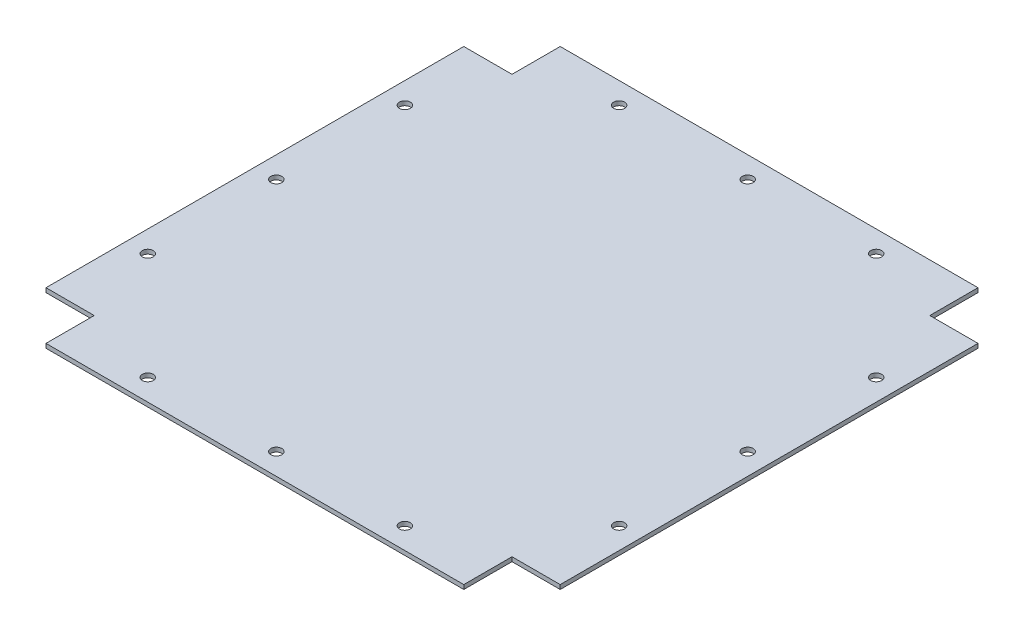
ISO-10303-21;
HEADER;
FILE_DESCRIPTION(('STEP AP214'),'2;1');
FILE_NAME('part.step','',(''),(''),'','','');
FILE_SCHEMA(('AUTOMOTIVE_DESIGN { 1 0 10303 214 1 1 1 1 }'));
ENDSEC;
DATA;
#1=APPLICATION_CONTEXT('core data for automotive mechanical design processes');
#2=APPLICATION_PROTOCOL_DEFINITION('international standard','automotive_design',2000,#1);
#3=PRODUCT_CONTEXT('',#1,'mechanical');
#4=PRODUCT('Part','Part','',(#3));
#5=PRODUCT_RELATED_PRODUCT_CATEGORY('part','',(#4));
#6=PRODUCT_DEFINITION_FORMATION('','',#4);
#7=PRODUCT_DEFINITION_CONTEXT('part definition',#1,'design');
#8=PRODUCT_DEFINITION('design','',#6,#7);
#9=PRODUCT_DEFINITION_SHAPE('','',#8);
#10=(LENGTH_UNIT() NAMED_UNIT(*) SI_UNIT(.MILLI.,.METRE.));
#11=(NAMED_UNIT(*) PLANE_ANGLE_UNIT() SI_UNIT($,.RADIAN.));
#12=(NAMED_UNIT(*) SI_UNIT($,.STERADIAN.) SOLID_ANGLE_UNIT());
#13=UNCERTAINTY_MEASURE_WITH_UNIT(LENGTH_MEASURE(1.E-05),#10,'distance_accuracy_value','');
#14=(GEOMETRIC_REPRESENTATION_CONTEXT(3) GLOBAL_UNCERTAINTY_ASSIGNED_CONTEXT((#13)) GLOBAL_UNIT_ASSIGNED_CONTEXT((#10,
#11,#12)) REPRESENTATION_CONTEXT('',''));
#15=CARTESIAN_POINT('',(0.,0.,0.));
#16=DIRECTION('',(0.,0.,1.));
#17=DIRECTION('',(1.,0.,0.));
#18=AXIS2_PLACEMENT_3D('',#15,#16,#17);
#19=CARTESIAN_POINT('',(0.,2.54,0.));
#20=DIRECTION('',(0.,-1.,0.));
#21=DIRECTION('',(0.,0.,-1.));
#22=AXIS2_PLACEMENT_3D('',#19,#20,#21);
#23=PLANE('',#22);
#24=CARTESIAN_POINT('',(-139.7,2.54,0.));
#25=DIRECTION('',(0.,1.,0.));
#26=DIRECTION('',(0.,0.,-1.));
#27=AXIS2_PLACEMENT_3D('',#24,#25,#26);
#28=CIRCLE('',#27,3.2385);
#29=CARTESIAN_POINT('',(-139.7,2.54,-3.23850000000006));
#30=VERTEX_POINT('',#29);
#31=EDGE_CURVE('E324',#30,#30,#28,.T.);
#32=ORIENTED_EDGE('',*,*,#31,.F.);
#33=EDGE_LOOP('',(#32));
#34=FACE_BOUND('',#33,.T.);
#35=CARTESIAN_POINT('',(139.7,2.54,-76.2000000000001));
#36=DIRECTION('',(0.,1.,0.));
#37=DIRECTION('',(0.,0.,1.));
#38=AXIS2_PLACEMENT_3D('',#35,#36,#37);
#39=CIRCLE('',#38,3.23850000000008);
#40=CARTESIAN_POINT('',(139.7,2.54,-72.9615000000001));
#41=VERTEX_POINT('',#40);
#42=EDGE_CURVE('E336',#41,#41,#39,.T.);
#43=ORIENTED_EDGE('',*,*,#42,.F.);
#44=EDGE_LOOP('',(#43));
#45=FACE_BOUND('',#44,.T.);
#46=CARTESIAN_POINT('',(139.7,2.54,76.1999999999999));
#47=DIRECTION('',(0.,1.,0.));
#48=DIRECTION('',(0.,0.,1.));
#49=AXIS2_PLACEMENT_3D('',#46,#47,#48);
#50=CIRCLE('',#49,3.23850000000004);
#51=CARTESIAN_POINT('',(139.7,2.54,79.4384999999999));
#52=VERTEX_POINT('',#51);
#53=EDGE_CURVE('E348',#52,#52,#50,.T.);
#54=ORIENTED_EDGE('',*,*,#53,.F.);
#55=EDGE_LOOP('',(#54));
#56=FACE_BOUND('',#55,.T.);
#57=CARTESIAN_POINT('',(0.,2.54,139.7));
#58=DIRECTION('',(0.,1.,0.));
#59=DIRECTION('',(0.,0.,-1.));
#60=AXIS2_PLACEMENT_3D('',#57,#58,#59);
#61=CIRCLE('',#60,3.23850000000002);
#62=CARTESIAN_POINT('',(0.,2.54,136.4615));
#63=VERTEX_POINT('',#62);
#64=EDGE_CURVE('E360',#63,#63,#61,.T.);
#65=ORIENTED_EDGE('',*,*,#64,.F.);
#66=EDGE_LOOP('',(#65));
#67=FACE_BOUND('',#66,.T.);
#68=CARTESIAN_POINT('',(-76.2,2.54,-139.7));
#69=DIRECTION('',(0.,1.,0.));
#70=DIRECTION('',(0.,0.,1.));
#71=AXIS2_PLACEMENT_3D('',#68,#69,#70);
#72=CIRCLE('',#71,3.2385);
#73=CARTESIAN_POINT('',(-76.2,2.54,-136.4615));
#74=VERTEX_POINT('',#73);
#75=EDGE_CURVE('E372',#74,#74,#72,.T.);
#76=ORIENTED_EDGE('',*,*,#75,.F.);
#77=EDGE_LOOP('',(#76));
#78=FACE_BOUND('',#77,.T.);
#79=CARTESIAN_POINT('',(76.2,2.54,-139.7));
#80=DIRECTION('',(0.,1.,0.));
#81=DIRECTION('',(0.,0.,1.));
#82=AXIS2_PLACEMENT_3D('',#79,#80,#81);
#83=CIRCLE('',#82,3.2385);
#84=CARTESIAN_POINT('',(76.2,2.54,-136.4615));
#85=VERTEX_POINT('',#84);
#86=EDGE_CURVE('E158',#85,#85,#83,.T.);
#87=ORIENTED_EDGE('',*,*,#86,.F.);
#88=EDGE_LOOP('',(#87));
#89=FACE_BOUND('',#88,.T.);
#90=DIRECTION('',(-1.,0.,0.));
#91=VECTOR('',#90,1.);
#92=CARTESIAN_POINT('',(-123.825,2.54,-152.4));
#93=LINE('',#92,#91);
#94=CARTESIAN_POINT('',(123.825,2.54,-152.4));
#95=VERTEX_POINT('',#94);
#96=CARTESIAN_POINT('',(-123.825,2.54,-152.4));
#97=VERTEX_POINT('',#96);
#98=EDGE_CURVE('E177',#95,#97,#93,.T.);
#99=ORIENTED_EDGE('',*,*,#98,.T.);
#100=DIRECTION('',(0.,0.,1.));
#101=VECTOR('',#100,1.);
#102=CARTESIAN_POINT('',(-123.825,2.54,-123.825));
#103=LINE('',#102,#101);
#104=CARTESIAN_POINT('',(-123.825,2.54,-123.825));
#105=VERTEX_POINT('',#104);
#106=EDGE_CURVE('E105',#97,#105,#103,.T.);
#107=ORIENTED_EDGE('',*,*,#106,.T.);
#108=DIRECTION('',(-1.,0.,0.));
#109=VECTOR('',#108,1.);
#110=CARTESIAN_POINT('',(-152.4,2.54,-123.825));
#111=LINE('',#110,#109);
#112=CARTESIAN_POINT('',(-152.4,2.54,-123.825));
#113=VERTEX_POINT('',#112);
#114=EDGE_CURVE('E204',#105,#113,#111,.T.);
#115=ORIENTED_EDGE('',*,*,#114,.T.);
#116=DIRECTION('',(0.,0.,1.));
#117=VECTOR('',#116,1.);
#118=CARTESIAN_POINT('',(-152.4,2.54,123.825));
#119=LINE('',#118,#117);
#120=CARTESIAN_POINT('',(-152.4,2.54,123.825));
#121=VERTEX_POINT('',#120);
#122=EDGE_CURVE('E223',#113,#121,#119,.T.);
#123=ORIENTED_EDGE('',*,*,#122,.T.);
#124=DIRECTION('',(1.,0.,0.));
#125=VECTOR('',#124,1.);
#126=CARTESIAN_POINT('',(-152.4,2.54,123.825));
#127=LINE('',#126,#125);
#128=CARTESIAN_POINT('',(-123.825,2.54,123.825));
#129=VERTEX_POINT('',#128);
#130=EDGE_CURVE('E220',#121,#129,#127,.T.);
#131=ORIENTED_EDGE('',*,*,#130,.T.);
#132=DIRECTION('',(0.,0.,1.));
#133=VECTOR('',#132,1.);
#134=CARTESIAN_POINT('',(-123.825,2.54,123.825));
#135=LINE('',#134,#133);
#136=CARTESIAN_POINT('',(-123.825,2.54,152.4));
#137=VERTEX_POINT('',#136);
#138=EDGE_CURVE('E222',#129,#137,#135,.T.);
#139=ORIENTED_EDGE('',*,*,#138,.T.);
#140=DIRECTION('',(1.,0.,0.));
#141=VECTOR('',#140,1.);
#142=CARTESIAN_POINT('',(-123.825,2.54,152.4));
#143=LINE('',#142,#141);
#144=CARTESIAN_POINT('',(123.825,2.54,152.4));
#145=VERTEX_POINT('',#144);
#146=EDGE_CURVE('E225',#137,#145,#143,.T.);
#147=ORIENTED_EDGE('',*,*,#146,.T.);
#148=DIRECTION('',(0.,0.,-1.));
#149=VECTOR('',#148,1.);
#150=CARTESIAN_POINT('',(123.825,2.54,152.4));
#151=LINE('',#150,#149);
#152=CARTESIAN_POINT('',(123.825,2.54,123.825));
#153=VERTEX_POINT('',#152);
#154=EDGE_CURVE('E231',#145,#153,#151,.T.);
#155=ORIENTED_EDGE('',*,*,#154,.T.);
#156=DIRECTION('',(1.,0.,0.));
#157=VECTOR('',#156,1.);
#158=CARTESIAN_POINT('',(123.825,2.54,123.825));
#159=LINE('',#158,#157);
#160=CARTESIAN_POINT('',(152.4,2.54,123.825));
#161=VERTEX_POINT('',#160);
#162=EDGE_CURVE('E136',#153,#161,#159,.T.);
#163=ORIENTED_EDGE('',*,*,#162,.T.);
#164=DIRECTION('',(0.,0.,-1.));
#165=VECTOR('',#164,1.);
#166=CARTESIAN_POINT('',(152.4,2.54,123.825));
#167=LINE('',#166,#165);
#168=CARTESIAN_POINT('',(152.4,2.54,-123.825));
#169=VERTEX_POINT('',#168);
#170=EDGE_CURVE('E130',#161,#169,#167,.T.);
#171=ORIENTED_EDGE('',*,*,#170,.T.);
#172=DIRECTION('',(-1.,0.,0.));
#173=VECTOR('',#172,1.);
#174=CARTESIAN_POINT('',(123.825,2.54,-123.825));
#175=LINE('',#174,#173);
#176=CARTESIAN_POINT('',(123.825,2.54,-123.825));
#177=VERTEX_POINT('',#176);
#178=EDGE_CURVE('E134',#169,#177,#175,.T.);
#179=ORIENTED_EDGE('',*,*,#178,.T.);
#180=DIRECTION('',(0.,0.,-1.));
#181=VECTOR('',#180,1.);
#182=CARTESIAN_POINT('',(123.825,2.54,-152.4));
#183=LINE('',#182,#181);
#184=EDGE_CURVE('E50',#177,#95,#183,.T.);
#185=ORIENTED_EDGE('',*,*,#184,.T.);
#186=EDGE_LOOP('',(#99,#107,#115,#123,#131,#139,#147,#155,#163,#171,#179,#185));
#187=FACE_BOUND('',#186,.T.);
#188=CARTESIAN_POINT('',(0.,2.54,-139.7));
#189=DIRECTION('',(0.,1.,0.));
#190=DIRECTION('',(0.,0.,1.));
#191=AXIS2_PLACEMENT_3D('',#188,#189,#190);
#192=CIRCLE('',#191,3.2385);
#193=CARTESIAN_POINT('',(0.,2.54,-136.4615));
#194=VERTEX_POINT('',#193);
#195=EDGE_CURVE('E378',#194,#194,#192,.T.);
#196=ORIENTED_EDGE('',*,*,#195,.F.);
#197=EDGE_LOOP('',(#196));
#198=FACE_BOUND('',#197,.T.);
#199=CARTESIAN_POINT('',(-76.2,2.54,139.7));
#200=DIRECTION('',(0.,1.,0.));
#201=DIRECTION('',(0.,0.,-1.));
#202=AXIS2_PLACEMENT_3D('',#199,#200,#201);
#203=CIRCLE('',#202,3.23849999999999);
#204=CARTESIAN_POINT('',(-76.2,2.54,136.4615));
#205=VERTEX_POINT('',#204);
#206=EDGE_CURVE('E366',#205,#205,#203,.T.);
#207=ORIENTED_EDGE('',*,*,#206,.F.);
#208=EDGE_LOOP('',(#207));
#209=FACE_BOUND('',#208,.T.);
#210=CARTESIAN_POINT('',(76.2,2.54,139.7));
#211=DIRECTION('',(0.,1.,0.));
#212=DIRECTION('',(0.,0.,-1.));
#213=AXIS2_PLACEMENT_3D('',#210,#211,#212);
#214=CIRCLE('',#213,3.23850000000002);
#215=CARTESIAN_POINT('',(76.2,2.54,136.4615));
#216=VERTEX_POINT('',#215);
#217=EDGE_CURVE('E354',#216,#216,#214,.T.);
#218=ORIENTED_EDGE('',*,*,#217,.F.);
#219=EDGE_LOOP('',(#218));
#220=FACE_BOUND('',#219,.T.);
#221=CARTESIAN_POINT('',(139.7,2.54,-1.11022302462516E-13));
#222=DIRECTION('',(0.,1.,0.));
#223=DIRECTION('',(0.,0.,1.));
#224=AXIS2_PLACEMENT_3D('',#221,#222,#223);
#225=CIRCLE('',#224,3.23850000000011);
#226=CARTESIAN_POINT('',(139.7,2.54,3.2385));
#227=VERTEX_POINT('',#226);
#228=EDGE_CURVE('E342',#227,#227,#225,.T.);
#229=ORIENTED_EDGE('',*,*,#228,.F.);
#230=EDGE_LOOP('',(#229));
#231=FACE_BOUND('',#230,.T.);
#232=CARTESIAN_POINT('',(-139.7,2.54,-76.2));
#233=DIRECTION('',(0.,1.,0.));
#234=DIRECTION('',(0.,0.,-1.));
#235=AXIS2_PLACEMENT_3D('',#232,#233,#234);
#236=CIRCLE('',#235,3.23850000000001);
#237=CARTESIAN_POINT('',(-139.7,2.54,-79.4385));
#238=VERTEX_POINT('',#237);
#239=EDGE_CURVE('E330',#238,#238,#236,.T.);
#240=ORIENTED_EDGE('',*,*,#239,.F.);
#241=EDGE_LOOP('',(#240));
#242=FACE_BOUND('',#241,.T.);
#243=CARTESIAN_POINT('',(-139.7,2.54,76.1999999999999));
#244=DIRECTION('',(0.,1.,0.));
#245=DIRECTION('',(0.,0.,-1.));
#246=AXIS2_PLACEMENT_3D('',#243,#244,#245);
#247=CIRCLE('',#246,3.23850000000002);
#248=CARTESIAN_POINT('',(-139.7,2.54,72.9614999999999));
#249=VERTEX_POINT('',#248);
#250=EDGE_CURVE('E315',#249,#249,#247,.T.);
#251=ORIENTED_EDGE('',*,*,#250,.F.);
#252=EDGE_LOOP('',(#251));
#253=FACE_BOUND('',#252,.T.);
#254=ADVANCED_FACE('F33',(#34,#45,#56,#67,#78,#89,#187,#198,#209,#220,#231,#242,#253),#23,.F.);
#255=CARTESIAN_POINT('',(0.,0.,0.));
#256=DIRECTION('',(0.,-1.,0.));
#257=DIRECTION('',(0.,0.,-1.));
#258=AXIS2_PLACEMENT_3D('',#255,#256,#257);
#259=PLANE('',#258);
#260=CARTESIAN_POINT('',(-139.7,0.,0.));
#261=DIRECTION('',(0.,1.,0.));
#262=DIRECTION('',(0.,0.,-1.));
#263=AXIS2_PLACEMENT_3D('',#260,#261,#262);
#264=CIRCLE('',#263,3.2385);
#265=CARTESIAN_POINT('',(-139.7,0.,-3.23850000000006));
#266=VERTEX_POINT('',#265);
#267=EDGE_CURVE('E321',#266,#266,#264,.T.);
#268=ORIENTED_EDGE('',*,*,#267,.T.);
#269=EDGE_LOOP('',(#268));
#270=FACE_BOUND('',#269,.T.);
#271=CARTESIAN_POINT('',(139.7,0.,-76.2000000000001));
#272=DIRECTION('',(0.,1.,0.));
#273=DIRECTION('',(0.,0.,1.));
#274=AXIS2_PLACEMENT_3D('',#271,#272,#273);
#275=CIRCLE('',#274,3.23850000000008);
#276=CARTESIAN_POINT('',(139.7,0.,-72.9615000000001));
#277=VERTEX_POINT('',#276);
#278=EDGE_CURVE('E333',#277,#277,#275,.T.);
#279=ORIENTED_EDGE('',*,*,#278,.T.);
#280=EDGE_LOOP('',(#279));
#281=FACE_BOUND('',#280,.T.);
#282=CARTESIAN_POINT('',(139.7,0.,76.1999999999999));
#283=DIRECTION('',(0.,1.,0.));
#284=DIRECTION('',(0.,0.,1.));
#285=AXIS2_PLACEMENT_3D('',#282,#283,#284);
#286=CIRCLE('',#285,3.23850000000004);
#287=CARTESIAN_POINT('',(139.7,0.,79.4384999999999));
#288=VERTEX_POINT('',#287);
#289=EDGE_CURVE('E345',#288,#288,#286,.T.);
#290=ORIENTED_EDGE('',*,*,#289,.T.);
#291=EDGE_LOOP('',(#290));
#292=FACE_BOUND('',#291,.T.);
#293=CARTESIAN_POINT('',(0.,0.,139.7));
#294=DIRECTION('',(0.,1.,0.));
#295=DIRECTION('',(0.,0.,-1.));
#296=AXIS2_PLACEMENT_3D('',#293,#294,#295);
#297=CIRCLE('',#296,3.23850000000002);
#298=CARTESIAN_POINT('',(0.,0.,136.4615));
#299=VERTEX_POINT('',#298);
#300=EDGE_CURVE('E357',#299,#299,#297,.T.);
#301=ORIENTED_EDGE('',*,*,#300,.T.);
#302=EDGE_LOOP('',(#301));
#303=FACE_BOUND('',#302,.T.);
#304=CARTESIAN_POINT('',(-76.2,0.,-139.7));
#305=DIRECTION('',(0.,1.,0.));
#306=DIRECTION('',(0.,0.,1.));
#307=AXIS2_PLACEMENT_3D('',#304,#305,#306);
#308=CIRCLE('',#307,3.2385);
#309=CARTESIAN_POINT('',(-76.2,0.,-136.4615));
#310=VERTEX_POINT('',#309);
#311=EDGE_CURVE('E369',#310,#310,#308,.T.);
#312=ORIENTED_EDGE('',*,*,#311,.T.);
#313=EDGE_LOOP('',(#312));
#314=FACE_BOUND('',#313,.T.);
#315=CARTESIAN_POINT('',(76.2,0.,-139.7));
#316=DIRECTION('',(0.,1.,0.));
#317=DIRECTION('',(0.,0.,1.));
#318=AXIS2_PLACEMENT_3D('',#315,#316,#317);
#319=CIRCLE('',#318,3.2385);
#320=CARTESIAN_POINT('',(76.2,0.,-136.4615));
#321=VERTEX_POINT('',#320);
#322=EDGE_CURVE('E381',#321,#321,#319,.T.);
#323=ORIENTED_EDGE('',*,*,#322,.T.);
#324=EDGE_LOOP('',(#323));
#325=FACE_BOUND('',#324,.T.);
#326=DIRECTION('',(-1.,0.,0.));
#327=VECTOR('',#326,1.);
#328=CARTESIAN_POINT('',(-123.825,0.,-152.4));
#329=LINE('',#328,#327);
#330=CARTESIAN_POINT('',(123.825,0.,-152.4));
#331=VERTEX_POINT('',#330);
#332=CARTESIAN_POINT('',(-123.825,0.,-152.4));
#333=VERTEX_POINT('',#332);
#334=EDGE_CURVE('E154',#331,#333,#329,.T.);
#335=ORIENTED_EDGE('',*,*,#334,.F.);
#336=DIRECTION('',(0.,0.,-1.));
#337=VECTOR('',#336,1.);
#338=CARTESIAN_POINT('',(123.825,0.,-152.4));
#339=LINE('',#338,#337);
#340=CARTESIAN_POINT('',(123.825,0.,-123.825));
#341=VERTEX_POINT('',#340);
#342=EDGE_CURVE('E97',#341,#331,#339,.T.);
#343=ORIENTED_EDGE('',*,*,#342,.F.);
#344=DIRECTION('',(-1.,0.,0.));
#345=VECTOR('',#344,1.);
#346=CARTESIAN_POINT('',(123.825,0.,-123.825));
#347=LINE('',#346,#345);
#348=CARTESIAN_POINT('',(152.4,0.,-123.825));
#349=VERTEX_POINT('',#348);
#350=EDGE_CURVE('E91',#349,#341,#347,.T.);
#351=ORIENTED_EDGE('',*,*,#350,.F.);
#352=DIRECTION('',(0.,0.,-1.));
#353=VECTOR('',#352,1.);
#354=CARTESIAN_POINT('',(152.4,0.,123.825));
#355=LINE('',#354,#353);
#356=CARTESIAN_POINT('',(152.4,0.,123.825));
#357=VERTEX_POINT('',#356);
#358=EDGE_CURVE('E144',#357,#349,#355,.T.);
#359=ORIENTED_EDGE('',*,*,#358,.F.);
#360=DIRECTION('',(1.,0.,0.));
#361=VECTOR('',#360,1.);
#362=CARTESIAN_POINT('',(123.825,0.,123.825));
#363=LINE('',#362,#361);
#364=CARTESIAN_POINT('',(123.825,0.,123.825));
#365=VERTEX_POINT('',#364);
#366=EDGE_CURVE('E172',#365,#357,#363,.T.);
#367=ORIENTED_EDGE('',*,*,#366,.F.);
#368=DIRECTION('',(0.,0.,-1.));
#369=VECTOR('',#368,1.);
#370=CARTESIAN_POINT('',(123.825,0.,152.4));
#371=LINE('',#370,#369);
#372=CARTESIAN_POINT('',(123.825,0.,152.4));
#373=VERTEX_POINT('',#372);
#374=EDGE_CURVE('E170',#373,#365,#371,.T.);
#375=ORIENTED_EDGE('',*,*,#374,.F.);
#376=DIRECTION('',(1.,0.,0.));
#377=VECTOR('',#376,1.);
#378=CARTESIAN_POINT('',(-123.825,0.,152.4));
#379=LINE('',#378,#377);
#380=CARTESIAN_POINT('',(-123.825,0.,152.4));
#381=VERTEX_POINT('',#380);
#382=EDGE_CURVE('E168',#381,#373,#379,.T.);
#383=ORIENTED_EDGE('',*,*,#382,.F.);
#384=DIRECTION('',(0.,0.,1.));
#385=VECTOR('',#384,1.);
#386=CARTESIAN_POINT('',(-123.825,0.,123.825));
#387=LINE('',#386,#385);
#388=CARTESIAN_POINT('',(-123.825,0.,123.825));
#389=VERTEX_POINT('',#388);
#390=EDGE_CURVE('E166',#389,#381,#387,.T.);
#391=ORIENTED_EDGE('',*,*,#390,.F.);
#392=DIRECTION('',(1.,0.,0.));
#393=VECTOR('',#392,1.);
#394=CARTESIAN_POINT('',(-152.4,0.,123.825));
#395=LINE('',#394,#393);
#396=CARTESIAN_POINT('',(-152.4,0.,123.825));
#397=VERTEX_POINT('',#396);
#398=EDGE_CURVE('E164',#397,#389,#395,.T.);
#399=ORIENTED_EDGE('',*,*,#398,.F.);
#400=DIRECTION('',(0.,0.,1.));
#401=VECTOR('',#400,1.);
#402=CARTESIAN_POINT('',(-152.4,0.,123.825));
#403=LINE('',#402,#401);
#404=CARTESIAN_POINT('',(-152.4,0.,-123.825));
#405=VERTEX_POINT('',#404);
#406=EDGE_CURVE('E162',#405,#397,#403,.T.);
#407=ORIENTED_EDGE('',*,*,#406,.F.);
#408=DIRECTION('',(-1.,0.,0.));
#409=VECTOR('',#408,1.);
#410=CARTESIAN_POINT('',(-152.4,0.,-123.825));
#411=LINE('',#410,#409);
#412=CARTESIAN_POINT('',(-123.825,0.,-123.825));
#413=VERTEX_POINT('',#412);
#414=EDGE_CURVE('E160',#413,#405,#411,.T.);
#415=ORIENTED_EDGE('',*,*,#414,.F.);
#416=DIRECTION('',(0.,0.,1.));
#417=VECTOR('',#416,1.);
#418=CARTESIAN_POINT('',(-123.825,0.,-123.825));
#419=LINE('',#418,#417);
#420=EDGE_CURVE('E157',#333,#413,#419,.T.);
#421=ORIENTED_EDGE('',*,*,#420,.F.);
#422=EDGE_LOOP('',(#335,#343,#351,#359,#367,#375,#383,#391,#399,#407,#415,#421));
#423=FACE_BOUND('',#422,.T.);
#424=CARTESIAN_POINT('',(0.,0.,-139.7));
#425=DIRECTION('',(0.,1.,0.));
#426=DIRECTION('',(0.,0.,1.));
#427=AXIS2_PLACEMENT_3D('',#424,#425,#426);
#428=CIRCLE('',#427,3.2385);
#429=CARTESIAN_POINT('',(0.,0.,-136.4615));
#430=VERTEX_POINT('',#429);
#431=EDGE_CURVE('E375',#430,#430,#428,.T.);
#432=ORIENTED_EDGE('',*,*,#431,.T.);
#433=EDGE_LOOP('',(#432));
#434=FACE_BOUND('',#433,.T.);
#435=CARTESIAN_POINT('',(-76.2,0.,139.7));
#436=DIRECTION('',(0.,1.,0.));
#437=DIRECTION('',(0.,0.,-1.));
#438=AXIS2_PLACEMENT_3D('',#435,#436,#437);
#439=CIRCLE('',#438,3.23849999999999);
#440=CARTESIAN_POINT('',(-76.2,0.,136.4615));
#441=VERTEX_POINT('',#440);
#442=EDGE_CURVE('E363',#441,#441,#439,.T.);
#443=ORIENTED_EDGE('',*,*,#442,.T.);
#444=EDGE_LOOP('',(#443));
#445=FACE_BOUND('',#444,.T.);
#446=CARTESIAN_POINT('',(76.2,0.,139.7));
#447=DIRECTION('',(0.,1.,0.));
#448=DIRECTION('',(0.,0.,-1.));
#449=AXIS2_PLACEMENT_3D('',#446,#447,#448);
#450=CIRCLE('',#449,3.23850000000002);
#451=CARTESIAN_POINT('',(76.2,0.,136.4615));
#452=VERTEX_POINT('',#451);
#453=EDGE_CURVE('E351',#452,#452,#450,.T.);
#454=ORIENTED_EDGE('',*,*,#453,.T.);
#455=EDGE_LOOP('',(#454));
#456=FACE_BOUND('',#455,.T.);
#457=CARTESIAN_POINT('',(139.7,0.,-1.11022302462516E-13));
#458=DIRECTION('',(0.,1.,0.));
#459=DIRECTION('',(0.,0.,1.));
#460=AXIS2_PLACEMENT_3D('',#457,#458,#459);
#461=CIRCLE('',#460,3.23850000000011);
#462=CARTESIAN_POINT('',(139.7,0.,3.2385));
#463=VERTEX_POINT('',#462);
#464=EDGE_CURVE('E339',#463,#463,#461,.T.);
#465=ORIENTED_EDGE('',*,*,#464,.T.);
#466=EDGE_LOOP('',(#465));
#467=FACE_BOUND('',#466,.T.);
#468=CARTESIAN_POINT('',(-139.7,0.,-76.2));
#469=DIRECTION('',(0.,1.,0.));
#470=DIRECTION('',(0.,0.,-1.));
#471=AXIS2_PLACEMENT_3D('',#468,#469,#470);
#472=CIRCLE('',#471,3.23850000000001);
#473=CARTESIAN_POINT('',(-139.7,0.,-79.4385));
#474=VERTEX_POINT('',#473);
#475=EDGE_CURVE('E327',#474,#474,#472,.T.);
#476=ORIENTED_EDGE('',*,*,#475,.T.);
#477=EDGE_LOOP('',(#476));
#478=FACE_BOUND('',#477,.T.);
#479=CARTESIAN_POINT('',(-139.7,0.,76.1999999999999));
#480=DIRECTION('',(0.,1.,0.));
#481=DIRECTION('',(0.,0.,-1.));
#482=AXIS2_PLACEMENT_3D('',#479,#480,#481);
#483=CIRCLE('',#482,3.23850000000002);
#484=CARTESIAN_POINT('',(-139.7,0.,72.9614999999999));
#485=VERTEX_POINT('',#484);
#486=EDGE_CURVE('E318',#485,#485,#483,.T.);
#487=ORIENTED_EDGE('',*,*,#486,.T.);
#488=EDGE_LOOP('',(#487));
#489=FACE_BOUND('',#488,.T.);
#490=ADVANCED_FACE('F208',(#270,#281,#292,#303,#314,#325,#423,#434,#445,#456,#467,#478,#489),
#259,.T.);
#491=CARTESIAN_POINT('',(-123.825,2.54,-152.4));
#492=DIRECTION('',(0.,0.,1.));
#493=DIRECTION('',(1.,0.,0.));
#494=AXIS2_PLACEMENT_3D('',#491,#492,#493);
#495=PLANE('',#494);
#496=ORIENTED_EDGE('',*,*,#334,.T.);
#497=DIRECTION('',(0.,-1.,0.));
#498=VECTOR('',#497,1.);
#499=CARTESIAN_POINT('',(-123.825,2.54,-152.4));
#500=LINE('',#499,#498);
#501=EDGE_CURVE('E11',#97,#333,#500,.T.);
#502=ORIENTED_EDGE('',*,*,#501,.F.);
#503=ORIENTED_EDGE('',*,*,#98,.F.);
#504=DIRECTION('',(0.,-1.,0.));
#505=VECTOR('',#504,1.);
#506=CARTESIAN_POINT('',(123.825,2.54,-152.4));
#507=LINE('',#506,#505);
#508=EDGE_CURVE('E150',#95,#331,#507,.T.);
#509=ORIENTED_EDGE('',*,*,#508,.T.);
#510=EDGE_LOOP('',(#496,#502,#503,#509));
#511=FACE_BOUND('',#510,.T.);
#512=ADVANCED_FACE('F35',(#511),#495,.F.);
#513=CARTESIAN_POINT('',(-123.825,2.54,-123.825));
#514=DIRECTION('',(1.,0.,0.));
#515=DIRECTION('',(0.,0.,-1.));
#516=AXIS2_PLACEMENT_3D('',#513,#514,#515);
#517=PLANE('',#516);
#518=ORIENTED_EDGE('',*,*,#420,.T.);
#519=DIRECTION('',(0.,-1.,0.));
#520=VECTOR('',#519,1.);
#521=CARTESIAN_POINT('',(-123.825,2.54,-123.825));
#522=LINE('',#521,#520);
#523=EDGE_CURVE('E42',#105,#413,#522,.T.);
#524=ORIENTED_EDGE('',*,*,#523,.F.);
#525=ORIENTED_EDGE('',*,*,#106,.F.);
#526=ORIENTED_EDGE('',*,*,#501,.T.);
#527=EDGE_LOOP('',(#518,#524,#525,#526));
#528=FACE_BOUND('',#527,.T.);
#529=ADVANCED_FACE('F562',(#528),#517,.F.);
#530=CARTESIAN_POINT('',(-152.4,2.54,-123.825));
#531=DIRECTION('',(0.,0.,1.));
#532=DIRECTION('',(1.,0.,0.));
#533=AXIS2_PLACEMENT_3D('',#530,#531,#532);
#534=PLANE('',#533);
#535=ORIENTED_EDGE('',*,*,#414,.T.);
#536=DIRECTION('',(0.,-1.,0.));
#537=VECTOR('',#536,1.);
#538=CARTESIAN_POINT('',(-152.4,2.54,-123.825));
#539=LINE('',#538,#537);
#540=EDGE_CURVE('E196',#113,#405,#539,.T.);
#541=ORIENTED_EDGE('',*,*,#540,.F.);
#542=ORIENTED_EDGE('',*,*,#114,.F.);
#543=ORIENTED_EDGE('',*,*,#523,.T.);
#544=EDGE_LOOP('',(#535,#541,#542,#543));
#545=FACE_BOUND('',#544,.T.);
#546=ADVANCED_FACE('F202',(#545),#534,.F.);
#547=CARTESIAN_POINT('',(-152.4,2.54,123.825));
#548=DIRECTION('',(1.,0.,0.));
#549=DIRECTION('',(0.,0.,-1.));
#550=AXIS2_PLACEMENT_3D('',#547,#548,#549);
#551=PLANE('',#550);
#552=ORIENTED_EDGE('',*,*,#406,.T.);
#553=DIRECTION('',(0.,-1.,0.));
#554=VECTOR('',#553,1.);
#555=CARTESIAN_POINT('',(-152.4,2.54,123.825));
#556=LINE('',#555,#554);
#557=EDGE_CURVE('E193',#121,#397,#556,.T.);
#558=ORIENTED_EDGE('',*,*,#557,.F.);
#559=ORIENTED_EDGE('',*,*,#122,.F.);
#560=ORIENTED_EDGE('',*,*,#540,.T.);
#561=EDGE_LOOP('',(#552,#558,#559,#560));
#562=FACE_BOUND('',#561,.T.);
#563=ADVANCED_FACE('F214',(#562),#551,.F.);
#564=CARTESIAN_POINT('',(-152.4,2.54,123.825));
#565=DIRECTION('',(0.,0.,-1.));
#566=DIRECTION('',(-1.,0.,0.));
#567=AXIS2_PLACEMENT_3D('',#564,#565,#566);
#568=PLANE('',#567);
#569=ORIENTED_EDGE('',*,*,#398,.T.);
#570=DIRECTION('',(0.,-1.,0.));
#571=VECTOR('',#570,1.);
#572=CARTESIAN_POINT('',(-123.825,2.54,123.825));
#573=LINE('',#572,#571);
#574=EDGE_CURVE('E190',#129,#389,#573,.T.);
#575=ORIENTED_EDGE('',*,*,#574,.F.);
#576=ORIENTED_EDGE('',*,*,#130,.F.);
#577=ORIENTED_EDGE('',*,*,#557,.T.);
#578=EDGE_LOOP('',(#569,#575,#576,#577));
#579=FACE_BOUND('',#578,.T.);
#580=ADVANCED_FACE('F218',(#579),#568,.F.);
#581=CARTESIAN_POINT('',(-123.825,2.54,123.825));
#582=DIRECTION('',(1.,0.,0.));
#583=DIRECTION('',(0.,0.,-1.));
#584=AXIS2_PLACEMENT_3D('',#581,#582,#583);
#585=PLANE('',#584);
#586=ORIENTED_EDGE('',*,*,#390,.T.);
#587=DIRECTION('',(0.,-1.,0.));
#588=VECTOR('',#587,1.);
#589=CARTESIAN_POINT('',(-123.825,2.54,152.4));
#590=LINE('',#589,#588);
#591=EDGE_CURVE('E187',#137,#381,#590,.T.);
#592=ORIENTED_EDGE('',*,*,#591,.F.);
#593=ORIENTED_EDGE('',*,*,#138,.F.);
#594=ORIENTED_EDGE('',*,*,#574,.T.);
#595=EDGE_LOOP('',(#586,#592,#593,#594));
#596=FACE_BOUND('',#595,.T.);
#597=ADVANCED_FACE('F527',(#596),#585,.F.);
#598=CARTESIAN_POINT('',(-123.825,2.54,152.4));
#599=DIRECTION('',(0.,0.,-1.));
#600=DIRECTION('',(-1.,0.,0.));
#601=AXIS2_PLACEMENT_3D('',#598,#599,#600);
#602=PLANE('',#601);
#603=ORIENTED_EDGE('',*,*,#382,.T.);
#604=DIRECTION('',(0.,-1.,0.));
#605=VECTOR('',#604,1.);
#606=CARTESIAN_POINT('',(123.825,2.54,152.4));
#607=LINE('',#606,#605);
#608=EDGE_CURVE('E184',#145,#373,#607,.T.);
#609=ORIENTED_EDGE('',*,*,#608,.F.);
#610=ORIENTED_EDGE('',*,*,#146,.F.);
#611=ORIENTED_EDGE('',*,*,#591,.T.);
#612=EDGE_LOOP('',(#603,#609,#610,#611));
#613=FACE_BOUND('',#612,.T.);
#614=ADVANCED_FACE('F518',(#613),#602,.F.);
#615=CARTESIAN_POINT('',(123.825,2.54,152.4));
#616=DIRECTION('',(-1.,0.,0.));
#617=DIRECTION('',(0.,0.,1.));
#618=AXIS2_PLACEMENT_3D('',#615,#616,#617);
#619=PLANE('',#618);
#620=ORIENTED_EDGE('',*,*,#374,.T.);
#621=DIRECTION('',(0.,-1.,0.));
#622=VECTOR('',#621,1.);
#623=CARTESIAN_POINT('',(123.825,2.54,123.825));
#624=LINE('',#623,#622);
#625=EDGE_CURVE('E181',#153,#365,#624,.T.);
#626=ORIENTED_EDGE('',*,*,#625,.F.);
#627=ORIENTED_EDGE('',*,*,#154,.F.);
#628=ORIENTED_EDGE('',*,*,#608,.T.);
#629=EDGE_LOOP('',(#620,#626,#627,#628));
#630=FACE_BOUND('',#629,.T.);
#631=ADVANCED_FACE('F237',(#630),#619,.F.);
#632=CARTESIAN_POINT('',(123.825,2.54,123.825));
#633=DIRECTION('',(0.,0.,-1.));
#634=DIRECTION('',(-1.,0.,0.));
#635=AXIS2_PLACEMENT_3D('',#632,#633,#634);
#636=PLANE('',#635);
#637=ORIENTED_EDGE('',*,*,#366,.T.);
#638=DIRECTION('',(0.,-1.,0.));
#639=VECTOR('',#638,1.);
#640=CARTESIAN_POINT('',(152.4,2.54,123.825));
#641=LINE('',#640,#639);
#642=EDGE_CURVE('E145',#161,#357,#641,.T.);
#643=ORIENTED_EDGE('',*,*,#642,.F.);
#644=ORIENTED_EDGE('',*,*,#162,.F.);
#645=ORIENTED_EDGE('',*,*,#625,.T.);
#646=EDGE_LOOP('',(#637,#643,#644,#645));
#647=FACE_BOUND('',#646,.T.);
#648=ADVANCED_FACE('F241',(#647),#636,.F.);
#649=CARTESIAN_POINT('',(152.4,2.54,123.825));
#650=DIRECTION('',(-1.,0.,0.));
#651=DIRECTION('',(0.,0.,1.));
#652=AXIS2_PLACEMENT_3D('',#649,#650,#651);
#653=PLANE('',#652);
#654=ORIENTED_EDGE('',*,*,#358,.T.);
#655=DIRECTION('',(0.,-1.,0.));
#656=VECTOR('',#655,1.);
#657=CARTESIAN_POINT('',(152.4,2.54,-123.825));
#658=LINE('',#657,#656);
#659=EDGE_CURVE('E141',#169,#349,#658,.T.);
#660=ORIENTED_EDGE('',*,*,#659,.F.);
#661=ORIENTED_EDGE('',*,*,#170,.F.);
#662=ORIENTED_EDGE('',*,*,#642,.T.);
#663=EDGE_LOOP('',(#654,#660,#661,#662));
#664=FACE_BOUND('',#663,.T.);
#665=ADVANCED_FACE('F142',(#664),#653,.F.);
#666=CARTESIAN_POINT('',(123.825,2.54,-123.825));
#667=DIRECTION('',(0.,0.,1.));
#668=DIRECTION('',(1.,0.,0.));
#669=AXIS2_PLACEMENT_3D('',#666,#667,#668);
#670=PLANE('',#669);
#671=ORIENTED_EDGE('',*,*,#350,.T.);
#672=DIRECTION('',(0.,-1.,0.));
#673=VECTOR('',#672,1.);
#674=CARTESIAN_POINT('',(123.825,2.54,-123.825));
#675=LINE('',#674,#673);
#676=EDGE_CURVE('E146',#177,#341,#675,.T.);
#677=ORIENTED_EDGE('',*,*,#676,.F.);
#678=ORIENTED_EDGE('',*,*,#178,.F.);
#679=ORIENTED_EDGE('',*,*,#659,.T.);
#680=EDGE_LOOP('',(#671,#677,#678,#679));
#681=FACE_BOUND('',#680,.T.);
#682=ADVANCED_FACE('F148',(#681),#670,.F.);
#683=CARTESIAN_POINT('',(123.825,2.54,-152.4));
#684=DIRECTION('',(-1.,0.,0.));
#685=DIRECTION('',(0.,0.,1.));
#686=AXIS2_PLACEMENT_3D('',#683,#684,#685);
#687=PLANE('',#686);
#688=ORIENTED_EDGE('',*,*,#342,.T.);
#689=ORIENTED_EDGE('',*,*,#508,.F.);
#690=ORIENTED_EDGE('',*,*,#184,.F.);
#691=ORIENTED_EDGE('',*,*,#676,.T.);
#692=EDGE_LOOP('',(#688,#689,#690,#691));
#693=FACE_BOUND('',#692,.T.);
#694=ADVANCED_FACE('F245',(#693),#687,.F.);
#695=CARTESIAN_POINT('',(76.2,2.54,-139.7));
#696=DIRECTION('',(0.,-1.,0.));
#697=DIRECTION('',(0.,0.,-1.));
#698=AXIS2_PLACEMENT_3D('',#695,#696,#697);
#699=CYLINDRICAL_SURFACE('',#698,3.2385);
#700=ORIENTED_EDGE('',*,*,#86,.T.);
#701=EDGE_LOOP('',(#700));
#702=FACE_BOUND('',#701,.T.);
#703=ORIENTED_EDGE('',*,*,#322,.F.);
#704=EDGE_LOOP('',(#703));
#705=FACE_BOUND('',#704,.T.);
#706=ADVANCED_FACE('F247',(#702,#705),#699,.F.);
#707=CARTESIAN_POINT('',(0.,2.54,-139.7));
#708=DIRECTION('',(0.,-1.,0.));
#709=DIRECTION('',(0.,0.,-1.));
#710=AXIS2_PLACEMENT_3D('',#707,#708,#709);
#711=CYLINDRICAL_SURFACE('',#710,3.2385);
#712=ORIENTED_EDGE('',*,*,#195,.T.);
#713=EDGE_LOOP('',(#712));
#714=FACE_BOUND('',#713,.T.);
#715=ORIENTED_EDGE('',*,*,#431,.F.);
#716=EDGE_LOOP('',(#715));
#717=FACE_BOUND('',#716,.T.);
#718=ADVANCED_FACE('F253',(#714,#717),#711,.F.);
#719=CARTESIAN_POINT('',(-76.2,2.54,-139.7));
#720=DIRECTION('',(0.,-1.,0.));
#721=DIRECTION('',(0.,0.,-1.));
#722=AXIS2_PLACEMENT_3D('',#719,#720,#721);
#723=CYLINDRICAL_SURFACE('',#722,3.2385);
#724=ORIENTED_EDGE('',*,*,#75,.T.);
#725=EDGE_LOOP('',(#724));
#726=FACE_BOUND('',#725,.T.);
#727=ORIENTED_EDGE('',*,*,#311,.F.);
#728=EDGE_LOOP('',(#727));
#729=FACE_BOUND('',#728,.T.);
#730=ADVANCED_FACE('F270',(#726,#729),#723,.F.);
#731=CARTESIAN_POINT('',(-76.2,2.54,139.7));
#732=DIRECTION('',(0.,-1.,0.));
#733=DIRECTION('',(0.,0.,-1.));
#734=AXIS2_PLACEMENT_3D('',#731,#732,#733);
#735=CYLINDRICAL_SURFACE('',#734,3.23849999999999);
#736=ORIENTED_EDGE('',*,*,#206,.T.);
#737=EDGE_LOOP('',(#736));
#738=FACE_BOUND('',#737,.T.);
#739=ORIENTED_EDGE('',*,*,#442,.F.);
#740=EDGE_LOOP('',(#739));
#741=FACE_BOUND('',#740,.T.);
#742=ADVANCED_FACE('F274',(#738,#741),#735,.F.);
#743=CARTESIAN_POINT('',(0.,2.54,139.7));
#744=DIRECTION('',(0.,-1.,0.));
#745=DIRECTION('',(0.,0.,-1.));
#746=AXIS2_PLACEMENT_3D('',#743,#744,#745);
#747=CYLINDRICAL_SURFACE('',#746,3.23850000000002);
#748=ORIENTED_EDGE('',*,*,#64,.T.);
#749=EDGE_LOOP('',(#748));
#750=FACE_BOUND('',#749,.T.);
#751=ORIENTED_EDGE('',*,*,#300,.F.);
#752=EDGE_LOOP('',(#751));
#753=FACE_BOUND('',#752,.T.);
#754=ADVANCED_FACE('F278',(#750,#753),#747,.F.);
#755=CARTESIAN_POINT('',(76.2,2.54,139.7));
#756=DIRECTION('',(0.,-1.,0.));
#757=DIRECTION('',(0.,0.,-1.));
#758=AXIS2_PLACEMENT_3D('',#755,#756,#757);
#759=CYLINDRICAL_SURFACE('',#758,3.23850000000002);
#760=ORIENTED_EDGE('',*,*,#217,.T.);
#761=EDGE_LOOP('',(#760));
#762=FACE_BOUND('',#761,.T.);
#763=ORIENTED_EDGE('',*,*,#453,.F.);
#764=EDGE_LOOP('',(#763));
#765=FACE_BOUND('',#764,.T.);
#766=ADVANCED_FACE('F282',(#762,#765),#759,.F.);
#767=CARTESIAN_POINT('',(139.7,2.54,76.1999999999999));
#768=DIRECTION('',(0.,-1.,0.));
#769=DIRECTION('',(0.,0.,-1.));
#770=AXIS2_PLACEMENT_3D('',#767,#768,#769);
#771=CYLINDRICAL_SURFACE('',#770,3.23850000000004);
#772=ORIENTED_EDGE('',*,*,#53,.T.);
#773=EDGE_LOOP('',(#772));
#774=FACE_BOUND('',#773,.T.);
#775=ORIENTED_EDGE('',*,*,#289,.F.);
#776=EDGE_LOOP('',(#775));
#777=FACE_BOUND('',#776,.T.);
#778=ADVANCED_FACE('F286',(#774,#777),#771,.F.);
#779=CARTESIAN_POINT('',(139.7,2.54,-1.11022302462516E-13));
#780=DIRECTION('',(0.,-1.,0.));
#781=DIRECTION('',(0.,0.,-1.));
#782=AXIS2_PLACEMENT_3D('',#779,#780,#781);
#783=CYLINDRICAL_SURFACE('',#782,3.23850000000011);
#784=ORIENTED_EDGE('',*,*,#228,.T.);
#785=EDGE_LOOP('',(#784));
#786=FACE_BOUND('',#785,.T.);
#787=ORIENTED_EDGE('',*,*,#464,.F.);
#788=EDGE_LOOP('',(#787));
#789=FACE_BOUND('',#788,.T.);
#790=ADVANCED_FACE('F290',(#786,#789),#783,.F.);
#791=CARTESIAN_POINT('',(139.7,2.54,-76.2000000000001));
#792=DIRECTION('',(0.,-1.,0.));
#793=DIRECTION('',(0.,0.,-1.));
#794=AXIS2_PLACEMENT_3D('',#791,#792,#793);
#795=CYLINDRICAL_SURFACE('',#794,3.23850000000008);
#796=ORIENTED_EDGE('',*,*,#42,.T.);
#797=EDGE_LOOP('',(#796));
#798=FACE_BOUND('',#797,.T.);
#799=ORIENTED_EDGE('',*,*,#278,.F.);
#800=EDGE_LOOP('',(#799));
#801=FACE_BOUND('',#800,.T.);
#802=ADVANCED_FACE('F294',(#798,#801),#795,.F.);
#803=CARTESIAN_POINT('',(-139.7,2.54,-76.2));
#804=DIRECTION('',(0.,-1.,0.));
#805=DIRECTION('',(0.,0.,-1.));
#806=AXIS2_PLACEMENT_3D('',#803,#804,#805);
#807=CYLINDRICAL_SURFACE('',#806,3.23850000000001);
#808=ORIENTED_EDGE('',*,*,#239,.T.);
#809=EDGE_LOOP('',(#808));
#810=FACE_BOUND('',#809,.T.);
#811=ORIENTED_EDGE('',*,*,#475,.F.);
#812=EDGE_LOOP('',(#811));
#813=FACE_BOUND('',#812,.T.);
#814=ADVANCED_FACE('F298',(#810,#813),#807,.F.);
#815=CARTESIAN_POINT('',(-139.7,2.54,0.));
#816=DIRECTION('',(0.,-1.,0.));
#817=DIRECTION('',(0.,0.,-1.));
#818=AXIS2_PLACEMENT_3D('',#815,#816,#817);
#819=CYLINDRICAL_SURFACE('',#818,3.2385);
#820=ORIENTED_EDGE('',*,*,#31,.T.);
#821=EDGE_LOOP('',(#820));
#822=FACE_BOUND('',#821,.T.);
#823=ORIENTED_EDGE('',*,*,#267,.F.);
#824=EDGE_LOOP('',(#823));
#825=FACE_BOUND('',#824,.T.);
#826=ADVANCED_FACE('F302',(#822,#825),#819,.F.);
#827=CARTESIAN_POINT('',(-139.7,2.54,76.1999999999999));
#828=DIRECTION('',(0.,-1.,0.));
#829=DIRECTION('',(0.,0.,-1.));
#830=AXIS2_PLACEMENT_3D('',#827,#828,#829);
#831=CYLINDRICAL_SURFACE('',#830,3.23850000000002);
#832=ORIENTED_EDGE('',*,*,#250,.T.);
#833=EDGE_LOOP('',(#832));
#834=FACE_BOUND('',#833,.T.);
#835=ORIENTED_EDGE('',*,*,#486,.F.);
#836=EDGE_LOOP('',(#835));
#837=FACE_BOUND('',#836,.T.);
#838=ADVANCED_FACE('F306',(#834,#837),#831,.F.);
#839=CLOSED_SHELL('',(#254,#490,#512,#529,#546,#563,#580,#597,#614,#631,#648,#665,#682,#694,
#706,#718,#730,#742,#754,#766,#778,#790,#802,#814,#826,#838));
#840=MANIFOLD_SOLID_BREP('B2',#839);
#841=ADVANCED_BREP_SHAPE_REPRESENTATION('',(#18,#840),#14);
#842=SHAPE_DEFINITION_REPRESENTATION(#9,#841);
ENDSEC;
END-ISO-10303-21;
